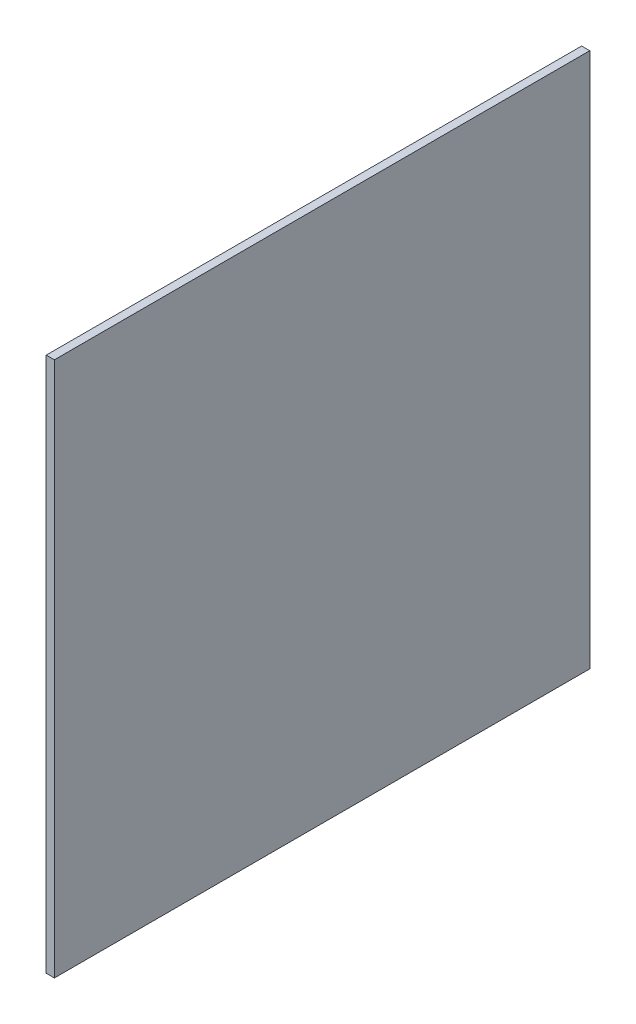
ISO-10303-21;
HEADER;
FILE_DESCRIPTION(('STEP AP214'),'2;1');
FILE_NAME('part.step','',(''),(''),'','','');
FILE_SCHEMA(('AUTOMOTIVE_DESIGN { 1 0 10303 214 1 1 1 1 }'));
ENDSEC;
DATA;
#1=APPLICATION_CONTEXT('core data for automotive mechanical design processes');
#2=APPLICATION_PROTOCOL_DEFINITION('international standard','automotive_design',2000,#1);
#3=PRODUCT_CONTEXT('',#1,'mechanical');
#4=PRODUCT('Part','Part','',(#3));
#5=PRODUCT_RELATED_PRODUCT_CATEGORY('part','',(#4));
#6=PRODUCT_DEFINITION_FORMATION('','',#4);
#7=PRODUCT_DEFINITION_CONTEXT('part definition',#1,'design');
#8=PRODUCT_DEFINITION('design','',#6,#7);
#9=PRODUCT_DEFINITION_SHAPE('','',#8);
#10=(LENGTH_UNIT() NAMED_UNIT(*) SI_UNIT(.MILLI.,.METRE.));
#11=(NAMED_UNIT(*) PLANE_ANGLE_UNIT() SI_UNIT($,.RADIAN.));
#12=(NAMED_UNIT(*) SI_UNIT($,.STERADIAN.) SOLID_ANGLE_UNIT());
#13=UNCERTAINTY_MEASURE_WITH_UNIT(LENGTH_MEASURE(1.E-05),#10,'distance_accuracy_value','');
#14=(GEOMETRIC_REPRESENTATION_CONTEXT(3) GLOBAL_UNCERTAINTY_ASSIGNED_CONTEXT((#13)) GLOBAL_UNIT_ASSIGNED_CONTEXT((#10,
#11,#12)) REPRESENTATION_CONTEXT('',''));
#15=CARTESIAN_POINT('',(0.,0.,0.));
#16=DIRECTION('',(0.,0.,1.));
#17=DIRECTION('',(1.,0.,0.));
#18=AXIS2_PLACEMENT_3D('',#15,#16,#17);
#19=CARTESIAN_POINT('',(-0.76,0.,0.));
#20=DIRECTION('',(0.,0.,1.));
#21=DIRECTION('',(1.,0.,0.));
#22=AXIS2_PLACEMENT_3D('',#19,#20,#21);
#23=PLANE('',#22);
#24=DIRECTION('',(0.,-1.,0.));
#25=VECTOR('',#24,1.);
#26=CARTESIAN_POINT('',(0.,0.,0.));
#27=LINE('',#26,#25);
#28=CARTESIAN_POINT('',(0.,50.,0.));
#29=VERTEX_POINT('',#28);
#30=CARTESIAN_POINT('',(0.,0.,0.));
#31=VERTEX_POINT('',#30);
#32=EDGE_CURVE('E103',#29,#31,#27,.T.);
#33=ORIENTED_EDGE('',*,*,#32,.F.);
#34=DIRECTION('',(1.,0.,0.));
#35=VECTOR('',#34,1.);
#36=CARTESIAN_POINT('',(-0.76,50.,0.));
#37=LINE('',#36,#35);
#38=CARTESIAN_POINT('',(-0.76,50.,0.));
#39=VERTEX_POINT('',#38);
#40=EDGE_CURVE('E11',#39,#29,#37,.T.);
#41=ORIENTED_EDGE('',*,*,#40,.F.);
#42=DIRECTION('',(0.,-1.,0.));
#43=VECTOR('',#42,1.);
#44=CARTESIAN_POINT('',(-0.76,0.,0.));
#45=LINE('',#44,#43);
#46=CARTESIAN_POINT('',(-0.76,0.,0.));
#47=VERTEX_POINT('',#46);
#48=EDGE_CURVE('E97',#39,#47,#45,.T.);
#49=ORIENTED_EDGE('',*,*,#48,.T.);
#50=DIRECTION('',(1.,0.,0.));
#51=VECTOR('',#50,1.);
#52=CARTESIAN_POINT('',(-0.76,0.,0.));
#53=LINE('',#52,#51);
#54=EDGE_CURVE('E42',#47,#31,#53,.T.);
#55=ORIENTED_EDGE('',*,*,#54,.T.);
#56=EDGE_LOOP('',(#33,#41,#49,#55));
#57=FACE_BOUND('',#56,.T.);
#58=ADVANCED_FACE('F39',(#57),#23,.T.);
#59=CARTESIAN_POINT('',(-0.76,50.,0.));
#60=DIRECTION('',(0.,1.,0.));
#61=DIRECTION('',(0.,0.,1.));
#62=AXIS2_PLACEMENT_3D('',#59,#60,#61);
#63=PLANE('',#62);
#64=DIRECTION('',(0.,0.,1.));
#65=VECTOR('',#64,1.);
#66=CARTESIAN_POINT('',(0.,50.,0.));
#67=LINE('',#66,#65);
#68=CARTESIAN_POINT('',(0.,50.,-50.));
#69=VERTEX_POINT('',#68);
#70=EDGE_CURVE('E99',#69,#29,#67,.T.);
#71=ORIENTED_EDGE('',*,*,#70,.F.);
#72=DIRECTION('',(1.,0.,0.));
#73=VECTOR('',#72,1.);
#74=CARTESIAN_POINT('',(-0.76,50.,-50.));
#75=LINE('',#74,#73);
#76=CARTESIAN_POINT('',(-0.76,50.,-50.));
#77=VERTEX_POINT('',#76);
#78=EDGE_CURVE('E48',#77,#69,#75,.T.);
#79=ORIENTED_EDGE('',*,*,#78,.F.);
#80=DIRECTION('',(0.,0.,1.));
#81=VECTOR('',#80,1.);
#82=CARTESIAN_POINT('',(-0.76,50.,0.));
#83=LINE('',#82,#81);
#84=EDGE_CURVE('E94',#77,#39,#83,.T.);
#85=ORIENTED_EDGE('',*,*,#84,.T.);
#86=ORIENTED_EDGE('',*,*,#40,.T.);
#87=EDGE_LOOP('',(#71,#79,#85,#86));
#88=FACE_BOUND('',#87,.T.);
#89=ADVANCED_FACE('F113',(#88),#63,.T.);
#90=CARTESIAN_POINT('',(-0.76,0.,-50.));
#91=DIRECTION('',(0.,0.,-1.));
#92=DIRECTION('',(-1.,0.,0.));
#93=AXIS2_PLACEMENT_3D('',#90,#91,#92);
#94=PLANE('',#93);
#95=DIRECTION('',(0.,1.,0.));
#96=VECTOR('',#95,1.);
#97=CARTESIAN_POINT('',(0.,0.,-50.));
#98=LINE('',#97,#96);
#99=CARTESIAN_POINT('',(0.,0.,-50.));
#100=VERTEX_POINT('',#99);
#101=EDGE_CURVE('E89',#100,#69,#98,.T.);
#102=ORIENTED_EDGE('',*,*,#101,.F.);
#103=DIRECTION('',(1.,0.,0.));
#104=VECTOR('',#103,1.);
#105=CARTESIAN_POINT('',(-0.76,0.,-50.));
#106=LINE('',#105,#104);
#107=CARTESIAN_POINT('',(-0.76,0.,-50.));
#108=VERTEX_POINT('',#107);
#109=EDGE_CURVE('E84',#108,#100,#106,.T.);
#110=ORIENTED_EDGE('',*,*,#109,.F.);
#111=DIRECTION('',(0.,1.,0.));
#112=VECTOR('',#111,1.);
#113=CARTESIAN_POINT('',(-0.76,0.,-50.));
#114=LINE('',#113,#112);
#115=EDGE_CURVE('E87',#108,#77,#114,.T.);
#116=ORIENTED_EDGE('',*,*,#115,.T.);
#117=ORIENTED_EDGE('',*,*,#78,.T.);
#118=EDGE_LOOP('',(#102,#110,#116,#117));
#119=FACE_BOUND('',#118,.T.);
#120=ADVANCED_FACE('F86',(#119),#94,.T.);
#121=CARTESIAN_POINT('',(-0.76,0.,0.));
#122=DIRECTION('',(0.,-1.,0.));
#123=DIRECTION('',(0.,0.,-1.));
#124=AXIS2_PLACEMENT_3D('',#121,#122,#123);
#125=PLANE('',#124);
#126=DIRECTION('',(0.,0.,-1.));
#127=VECTOR('',#126,1.);
#128=CARTESIAN_POINT('',(0.,0.,0.));
#129=LINE('',#128,#127);
#130=EDGE_CURVE('E106',#31,#100,#129,.T.);
#131=ORIENTED_EDGE('',*,*,#130,.F.);
#132=ORIENTED_EDGE('',*,*,#54,.F.);
#133=DIRECTION('',(0.,0.,-1.));
#134=VECTOR('',#133,1.);
#135=CARTESIAN_POINT('',(-0.76,0.,0.));
#136=LINE('',#135,#134);
#137=EDGE_CURVE('E93',#47,#108,#136,.T.);
#138=ORIENTED_EDGE('',*,*,#137,.T.);
#139=ORIENTED_EDGE('',*,*,#109,.T.);
#140=EDGE_LOOP('',(#131,#132,#138,#139));
#141=FACE_BOUND('',#140,.T.);
#142=ADVANCED_FACE('F96',(#141),#125,.T.);
#143=CARTESIAN_POINT('',(-0.76,0.,0.));
#144=DIRECTION('',(-1.,0.,0.));
#145=DIRECTION('',(0.,0.,1.));
#146=AXIS2_PLACEMENT_3D('',#143,#144,#145);
#147=PLANE('',#146);
#148=ORIENTED_EDGE('',*,*,#48,.F.);
#149=ORIENTED_EDGE('',*,*,#84,.F.);
#150=ORIENTED_EDGE('',*,*,#115,.F.);
#151=ORIENTED_EDGE('',*,*,#137,.F.);
#152=EDGE_LOOP('',(#148,#149,#150,#151));
#153=FACE_BOUND('',#152,.T.);
#154=ADVANCED_FACE('F92',(#153),#147,.T.);
#155=CARTESIAN_POINT('',(0.,0.,0.));
#156=DIRECTION('',(-1.,0.,0.));
#157=DIRECTION('',(0.,0.,1.));
#158=AXIS2_PLACEMENT_3D('',#155,#156,#157);
#159=PLANE('',#158);
#160=ORIENTED_EDGE('',*,*,#32,.T.);
#161=ORIENTED_EDGE('',*,*,#130,.T.);
#162=ORIENTED_EDGE('',*,*,#101,.T.);
#163=ORIENTED_EDGE('',*,*,#70,.T.);
#164=EDGE_LOOP('',(#160,#161,#162,#163));
#165=FACE_BOUND('',#164,.T.);
#166=ADVANCED_FACE('F112',(#165),#159,.F.);
#167=CLOSED_SHELL('',(#58,#89,#120,#142,#154,#166));
#168=MANIFOLD_SOLID_BREP('B2',#167);
#169=ADVANCED_BREP_SHAPE_REPRESENTATION('',(#18,#168),#14);
#170=SHAPE_DEFINITION_REPRESENTATION(#9,#169);
ENDSEC;
END-ISO-10303-21;
